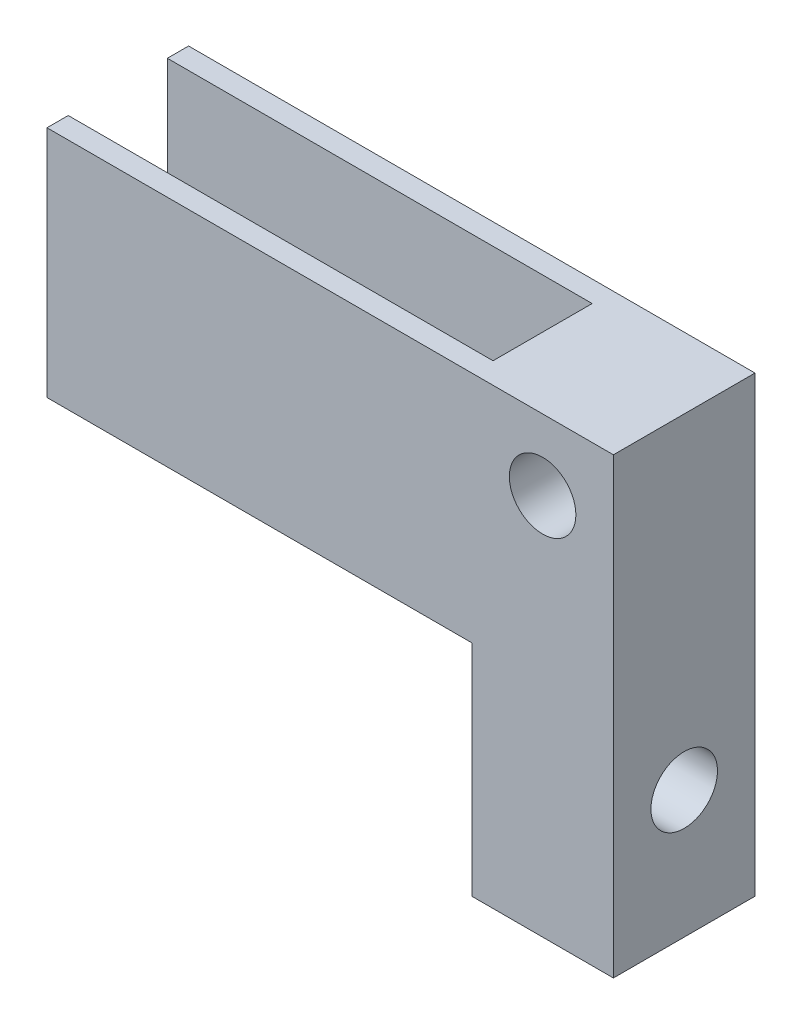
ISO-10303-21;
HEADER;
FILE_DESCRIPTION(('STEP AP214'),'2;1');
FILE_NAME('part.step','',(''),(''),'','','');
FILE_SCHEMA(('AUTOMOTIVE_DESIGN { 1 0 10303 214 1 1 1 1 }'));
ENDSEC;
DATA;
#1=APPLICATION_CONTEXT('core data for automotive mechanical design processes');
#2=APPLICATION_PROTOCOL_DEFINITION('international standard','automotive_design',2000,#1);
#3=PRODUCT_CONTEXT('',#1,'mechanical');
#4=PRODUCT('Part','Part','',(#3));
#5=PRODUCT_RELATED_PRODUCT_CATEGORY('part','',(#4));
#6=PRODUCT_DEFINITION_FORMATION('','',#4);
#7=PRODUCT_DEFINITION_CONTEXT('part definition',#1,'design');
#8=PRODUCT_DEFINITION('design','',#6,#7);
#9=PRODUCT_DEFINITION_SHAPE('','',#8);
#10=(LENGTH_UNIT() NAMED_UNIT(*) SI_UNIT(.MILLI.,.METRE.));
#11=(NAMED_UNIT(*) PLANE_ANGLE_UNIT() SI_UNIT($,.RADIAN.));
#12=(NAMED_UNIT(*) SI_UNIT($,.STERADIAN.) SOLID_ANGLE_UNIT());
#13=UNCERTAINTY_MEASURE_WITH_UNIT(LENGTH_MEASURE(1.E-05),#10,'distance_accuracy_value','');
#14=(GEOMETRIC_REPRESENTATION_CONTEXT(3) GLOBAL_UNCERTAINTY_ASSIGNED_CONTEXT((#13)) GLOBAL_UNIT_ASSIGNED_CONTEXT((#10,
#11,#12)) REPRESENTATION_CONTEXT('',''));
#15=CARTESIAN_POINT('',(0.,0.,0.));
#16=DIRECTION('',(0.,0.,1.));
#17=DIRECTION('',(1.,0.,0.));
#18=AXIS2_PLACEMENT_3D('',#15,#16,#17);
#19=CARTESIAN_POINT('',(0.,0.,10.));
#20=DIRECTION('',(-1.,0.,0.));
#21=DIRECTION('',(0.,-1.,0.));
#22=AXIS2_PLACEMENT_3D('',#19,#20,#21);
#23=PLANE('',#22);
#24=DIRECTION('',(0.,0.,1.));
#25=VECTOR('',#24,1.);
#26=CARTESIAN_POINT('',(0.,32.,10.));
#27=LINE('',#26,#25);
#28=CARTESIAN_POINT('',(0.,32.,1.5));
#29=VERTEX_POINT('',#28);
#30=CARTESIAN_POINT('',(0.,32.,8.5));
#31=VERTEX_POINT('',#30);
#32=EDGE_CURVE('E197',#29,#31,#27,.T.);
#33=ORIENTED_EDGE('',*,*,#32,.F.);
#34=DIRECTION('',(0.,1.,0.));
#35=VECTOR('',#34,1.);
#36=CARTESIAN_POINT('',(0.,36.5,1.5));
#37=LINE('',#36,#35);
#38=CARTESIAN_POINT('',(0.,15.5,1.5));
#39=VERTEX_POINT('',#38);
#40=EDGE_CURVE('E184',#39,#29,#37,.T.);
#41=ORIENTED_EDGE('',*,*,#40,.F.);
#42=DIRECTION('',(0.,0.,1.));
#43=VECTOR('',#42,1.);
#44=CARTESIAN_POINT('',(0.,15.5,1.5));
#45=LINE('',#44,#43);
#46=CARTESIAN_POINT('',(0.,15.5,0.));
#47=VERTEX_POINT('',#46);
#48=EDGE_CURVE('E115',#47,#39,#45,.T.);
#49=ORIENTED_EDGE('',*,*,#48,.F.);
#50=DIRECTION('',(0.,1.,0.));
#51=VECTOR('',#50,1.);
#52=CARTESIAN_POINT('',(0.,0.,0.));
#53=LINE('',#52,#51);
#54=CARTESIAN_POINT('',(0.,0.,0.));
#55=VERTEX_POINT('',#54);
#56=EDGE_CURVE('E136',#55,#47,#53,.T.);
#57=ORIENTED_EDGE('',*,*,#56,.F.);
#58=DIRECTION('',(0.,0.,-1.));
#59=VECTOR('',#58,1.);
#60=CARTESIAN_POINT('',(0.,0.,10.));
#61=LINE('',#60,#59);
#62=CARTESIAN_POINT('',(0.,0.,10.));
#63=VERTEX_POINT('',#62);
#64=EDGE_CURVE('E41',#63,#55,#61,.T.);
#65=ORIENTED_EDGE('',*,*,#64,.F.);
#66=DIRECTION('',(0.,1.,0.));
#67=VECTOR('',#66,1.);
#68=CARTESIAN_POINT('',(0.,0.,10.));
#69=LINE('',#68,#67);
#70=CARTESIAN_POINT('',(0.,15.5,10.));
#71=VERTEX_POINT('',#70);
#72=EDGE_CURVE('E55',#63,#71,#69,.T.);
#73=ORIENTED_EDGE('',*,*,#72,.T.);
#74=DIRECTION('',(0.,0.,1.));
#75=VECTOR('',#74,1.);
#76=CARTESIAN_POINT('',(0.,15.5,8.5));
#77=LINE('',#76,#75);
#78=CARTESIAN_POINT('',(0.,15.5,8.5));
#79=VERTEX_POINT('',#78);
#80=EDGE_CURVE('E168',#79,#71,#77,.T.);
#81=ORIENTED_EDGE('',*,*,#80,.F.);
#82=DIRECTION('',(0.,-1.,0.));
#83=VECTOR('',#82,1.);
#84=CARTESIAN_POINT('',(0.,36.5,8.5));
#85=LINE('',#84,#83);
#86=EDGE_CURVE('E171',#31,#79,#85,.T.);
#87=ORIENTED_EDGE('',*,*,#86,.F.);
#88=EDGE_LOOP('',(#33,#41,#49,#57,#65,#73,#81,#87));
#89=FACE_BOUND('',#88,.T.);
#90=CARTESIAN_POINT('',(0.,9.,5.));
#91=DIRECTION('',(-1.,0.,0.));
#92=DIRECTION('',(0.,-1.,0.));
#93=AXIS2_PLACEMENT_3D('',#90,#91,#92);
#94=CIRCLE('',#93,2.35);
#95=CARTESIAN_POINT('',(0.,6.65,5.));
#96=VERTEX_POINT('',#95);
#97=EDGE_CURVE('E156',#96,#96,#94,.T.);
#98=ORIENTED_EDGE('',*,*,#97,.F.);
#99=EDGE_LOOP('',(#98));
#100=FACE_BOUND('',#99,.T.);
#101=ADVANCED_FACE('F33',(#89,#100),#23,.T.);
#102=CARTESIAN_POINT('',(9.99999999999999,50.,10.));
#103=DIRECTION('',(1.,0.,0.));
#104=DIRECTION('',(0.,1.,0.));
#105=AXIS2_PLACEMENT_3D('',#102,#103,#104);
#106=PLANE('',#105);
#107=DIRECTION('',(0.,0.,-1.));
#108=VECTOR('',#107,1.);
#109=CARTESIAN_POINT('',(9.99999999999999,32.,10.));
#110=LINE('',#109,#108);
#111=CARTESIAN_POINT('',(9.99999999999998,32.,10.));
#112=VERTEX_POINT('',#111);
#113=CARTESIAN_POINT('',(9.99999999999998,32.,0.));
#114=VERTEX_POINT('',#113);
#115=EDGE_CURVE('E108',#112,#114,#110,.T.);
#116=ORIENTED_EDGE('',*,*,#115,.F.);
#117=DIRECTION('',(0.,-1.,0.));
#118=VECTOR('',#117,1.);
#119=CARTESIAN_POINT('',(9.99999999999999,50.,10.));
#120=LINE('',#119,#118);
#121=CARTESIAN_POINT('',(10.,0.,10.));
#122=VERTEX_POINT('',#121);
#123=EDGE_CURVE('E146',#112,#122,#120,.T.);
#124=ORIENTED_EDGE('',*,*,#123,.T.);
#125=DIRECTION('',(0.,0.,-1.));
#126=VECTOR('',#125,1.);
#127=CARTESIAN_POINT('',(10.,0.,10.));
#128=LINE('',#127,#126);
#129=CARTESIAN_POINT('',(10.,0.,0.));
#130=VERTEX_POINT('',#129);
#131=EDGE_CURVE('E131',#122,#130,#128,.T.);
#132=ORIENTED_EDGE('',*,*,#131,.T.);
#133=DIRECTION('',(0.,-1.,0.));
#134=VECTOR('',#133,1.);
#135=CARTESIAN_POINT('',(9.99999999999999,50.,0.));
#136=LINE('',#135,#134);
#137=EDGE_CURVE('E123',#114,#130,#136,.T.);
#138=ORIENTED_EDGE('',*,*,#137,.F.);
#139=EDGE_LOOP('',(#116,#124,#132,#138));
#140=FACE_BOUND('',#139,.T.);
#141=CARTESIAN_POINT('',(10.,9.,5.));
#142=DIRECTION('',(-1.,0.,0.));
#143=DIRECTION('',(0.,-1.,0.));
#144=AXIS2_PLACEMENT_3D('',#141,#142,#143);
#145=CIRCLE('',#144,2.35);
#146=CARTESIAN_POINT('',(10.,6.65,5.));
#147=VERTEX_POINT('',#146);
#148=EDGE_CURVE('E154',#147,#147,#145,.T.);
#149=ORIENTED_EDGE('',*,*,#148,.T.);
#150=EDGE_LOOP('',(#149));
#151=FACE_BOUND('',#150,.T.);
#152=ADVANCED_FACE('F35',(#140,#151),#106,.T.);
#153=CARTESIAN_POINT('',(10.,0.,10.));
#154=DIRECTION('',(0.,-1.,0.));
#155=DIRECTION('',(1.,0.,0.));
#156=AXIS2_PLACEMENT_3D('',#153,#154,#155);
#157=PLANE('',#156);
#158=DIRECTION('',(-1.,0.,0.));
#159=VECTOR('',#158,1.);
#160=CARTESIAN_POINT('',(10.,0.,0.));
#161=LINE('',#160,#159);
#162=EDGE_CURVE('E133',#130,#55,#161,.T.);
#163=ORIENTED_EDGE('',*,*,#162,.F.);
#164=ORIENTED_EDGE('',*,*,#131,.F.);
#165=DIRECTION('',(-1.,0.,0.));
#166=VECTOR('',#165,1.);
#167=CARTESIAN_POINT('',(10.,0.,10.));
#168=LINE('',#167,#166);
#169=EDGE_CURVE('E147',#122,#63,#168,.T.);
#170=ORIENTED_EDGE('',*,*,#169,.T.);
#171=ORIENTED_EDGE('',*,*,#64,.T.);
#172=EDGE_LOOP('',(#163,#164,#170,#171));
#173=FACE_BOUND('',#172,.T.);
#174=ADVANCED_FACE('F228',(#173),#157,.T.);
#175=CARTESIAN_POINT('',(0.,0.,10.));
#176=DIRECTION('',(0.,0.,-1.));
#177=DIRECTION('',(-1.,0.,0.));
#178=AXIS2_PLACEMENT_3D('',#175,#176,#177);
#179=PLANE('',#178);
#180=CARTESIAN_POINT('',(4.99999999999999,27.,10.));
#181=DIRECTION('',(0.,0.,1.));
#182=DIRECTION('',(1.,0.,0.));
#183=AXIS2_PLACEMENT_3D('',#180,#181,#182);
#184=CIRCLE('',#183,2.35);
#185=CARTESIAN_POINT('',(7.34999999999999,27.,10.));
#186=VERTEX_POINT('',#185);
#187=EDGE_CURVE('E139',#186,#186,#184,.T.);
#188=ORIENTED_EDGE('',*,*,#187,.F.);
#189=EDGE_LOOP('',(#188));
#190=FACE_BOUND('',#189,.T.);
#191=ORIENTED_EDGE('',*,*,#123,.F.);
#192=DIRECTION('',(1.,0.,0.));
#193=VECTOR('',#192,1.);
#194=CARTESIAN_POINT('',(-34.1391826025117,32.,10.));
#195=LINE('',#194,#193);
#196=CARTESIAN_POINT('',(-30.,32.,10.));
#197=VERTEX_POINT('',#196);
#198=EDGE_CURVE('E111',#197,#112,#195,.T.);
#199=ORIENTED_EDGE('',*,*,#198,.F.);
#200=DIRECTION('',(0.,1.,0.));
#201=VECTOR('',#200,1.);
#202=CARTESIAN_POINT('',(-30.,15.5,10.));
#203=LINE('',#202,#201);
#204=CARTESIAN_POINT('',(-30.,15.5,10.));
#205=VERTEX_POINT('',#204);
#206=EDGE_CURVE('E167',#205,#197,#203,.T.);
#207=ORIENTED_EDGE('',*,*,#206,.F.);
#208=DIRECTION('',(1.,0.,0.));
#209=VECTOR('',#208,1.);
#210=CARTESIAN_POINT('',(-30.,15.5,10.));
#211=LINE('',#210,#209);
#212=EDGE_CURVE('E164',#205,#71,#211,.T.);
#213=ORIENTED_EDGE('',*,*,#212,.T.);
#214=ORIENTED_EDGE('',*,*,#72,.F.);
#215=ORIENTED_EDGE('',*,*,#169,.F.);
#216=EDGE_LOOP('',(#191,#199,#207,#213,#214,#215));
#217=FACE_BOUND('',#216,.T.);
#218=ADVANCED_FACE('F227',(#190,#217),#179,.F.);
#219=CARTESIAN_POINT('',(0.,0.,0.));
#220=DIRECTION('',(0.,0.,-1.));
#221=DIRECTION('',(-1.,0.,0.));
#222=AXIS2_PLACEMENT_3D('',#219,#220,#221);
#223=PLANE('',#222);
#224=DIRECTION('',(1.,0.,0.));
#225=VECTOR('',#224,1.);
#226=CARTESIAN_POINT('',(-34.1391826025117,32.,0.));
#227=LINE('',#226,#225);
#228=CARTESIAN_POINT('',(-30.,32.,0.));
#229=VERTEX_POINT('',#228);
#230=EDGE_CURVE('E48',#229,#114,#227,.T.);
#231=ORIENTED_EDGE('',*,*,#230,.T.);
#232=ORIENTED_EDGE('',*,*,#137,.T.);
#233=ORIENTED_EDGE('',*,*,#162,.T.);
#234=ORIENTED_EDGE('',*,*,#56,.T.);
#235=DIRECTION('',(1.,0.,0.));
#236=VECTOR('',#235,1.);
#237=CARTESIAN_POINT('',(-30.,15.5,0.));
#238=LINE('',#237,#236);
#239=CARTESIAN_POINT('',(-30.,15.5,0.));
#240=VERTEX_POINT('',#239);
#241=EDGE_CURVE('E173',#240,#47,#238,.T.);
#242=ORIENTED_EDGE('',*,*,#241,.F.);
#243=DIRECTION('',(0.,-1.,0.));
#244=VECTOR('',#243,1.);
#245=CARTESIAN_POINT('',(-30.,15.5,0.));
#246=LINE('',#245,#244);
#247=EDGE_CURVE('E126',#229,#240,#246,.T.);
#248=ORIENTED_EDGE('',*,*,#247,.F.);
#249=EDGE_LOOP('',(#231,#232,#233,#234,#242,#248));
#250=FACE_BOUND('',#249,.T.);
#251=CARTESIAN_POINT('',(4.99999999999999,27.,0.));
#252=DIRECTION('',(0.,0.,1.));
#253=DIRECTION('',(1.,0.,0.));
#254=AXIS2_PLACEMENT_3D('',#251,#252,#253);
#255=CIRCLE('',#254,2.35);
#256=CARTESIAN_POINT('',(7.34999999999999,27.,0.));
#257=VERTEX_POINT('',#256);
#258=EDGE_CURVE('E134',#257,#257,#255,.T.);
#259=ORIENTED_EDGE('',*,*,#258,.T.);
#260=EDGE_LOOP('',(#259));
#261=FACE_BOUND('',#260,.T.);
#262=ADVANCED_FACE('F120',(#250,#261),#223,.T.);
#263=CARTESIAN_POINT('',(4.99999999999999,27.,0.));
#264=DIRECTION('',(0.,0.,1.));
#265=DIRECTION('',(1.,0.,0.));
#266=AXIS2_PLACEMENT_3D('',#263,#264,#265);
#267=CYLINDRICAL_SURFACE('',#266,2.35);
#268=ORIENTED_EDGE('',*,*,#258,.F.);
#269=EDGE_LOOP('',(#268));
#270=FACE_BOUND('',#269,.T.);
#271=ORIENTED_EDGE('',*,*,#187,.T.);
#272=EDGE_LOOP('',(#271));
#273=FACE_BOUND('',#272,.T.);
#274=ADVANCED_FACE('F255',(#270,#273),#267,.F.);
#275=CARTESIAN_POINT('',(10.,9.,5.));
#276=DIRECTION('',(-1.,0.,0.));
#277=DIRECTION('',(0.,-1.,0.));
#278=AXIS2_PLACEMENT_3D('',#275,#276,#277);
#279=CYLINDRICAL_SURFACE('',#278,2.35);
#280=ORIENTED_EDGE('',*,*,#148,.F.);
#281=EDGE_LOOP('',(#280));
#282=FACE_BOUND('',#281,.T.);
#283=ORIENTED_EDGE('',*,*,#97,.T.);
#284=EDGE_LOOP('',(#283));
#285=FACE_BOUND('',#284,.T.);
#286=ADVANCED_FACE('F238',(#282,#285),#279,.F.);
#287=CARTESIAN_POINT('',(-30.,36.5,8.5));
#288=DIRECTION('',(0.,0.,1.));
#289=DIRECTION('',(0.,-1.,0.));
#290=AXIS2_PLACEMENT_3D('',#287,#288,#289);
#291=PLANE('',#290);
#292=DIRECTION('',(0.,-1.,0.));
#293=VECTOR('',#292,1.);
#294=CARTESIAN_POINT('',(-30.,36.5,8.5));
#295=LINE('',#294,#293);
#296=CARTESIAN_POINT('',(-30.,32.,8.5));
#297=VERTEX_POINT('',#296);
#298=CARTESIAN_POINT('',(-30.,15.5,8.5));
#299=VERTEX_POINT('',#298);
#300=EDGE_CURVE('E170',#297,#299,#295,.T.);
#301=ORIENTED_EDGE('',*,*,#300,.F.);
#302=DIRECTION('',(1.,0.,0.));
#303=VECTOR('',#302,1.);
#304=CARTESIAN_POINT('',(-30.,32.,8.5));
#305=LINE('',#304,#303);
#306=EDGE_CURVE('E194',#297,#31,#305,.T.);
#307=ORIENTED_EDGE('',*,*,#306,.T.);
#308=ORIENTED_EDGE('',*,*,#86,.T.);
#309=DIRECTION('',(1.,0.,0.));
#310=VECTOR('',#309,1.);
#311=CARTESIAN_POINT('',(-30.,15.5,8.5));
#312=LINE('',#311,#310);
#313=EDGE_CURVE('E159',#299,#79,#312,.T.);
#314=ORIENTED_EDGE('',*,*,#313,.F.);
#315=EDGE_LOOP('',(#301,#307,#308,#314));
#316=FACE_BOUND('',#315,.T.);
#317=ADVANCED_FACE('F219',(#316),#291,.F.);
#318=CARTESIAN_POINT('',(-30.,15.5,8.5));
#319=DIRECTION('',(0.,1.,0.));
#320=DIRECTION('',(0.,0.,1.));
#321=AXIS2_PLACEMENT_3D('',#318,#319,#320);
#322=PLANE('',#321);
#323=ORIENTED_EDGE('',*,*,#80,.T.);
#324=ORIENTED_EDGE('',*,*,#212,.F.);
#325=DIRECTION('',(0.,0.,1.));
#326=VECTOR('',#325,1.);
#327=CARTESIAN_POINT('',(-30.,15.5,8.5));
#328=LINE('',#327,#326);
#329=EDGE_CURVE('E176',#299,#205,#328,.T.);
#330=ORIENTED_EDGE('',*,*,#329,.F.);
#331=ORIENTED_EDGE('',*,*,#313,.T.);
#332=EDGE_LOOP('',(#323,#324,#330,#331));
#333=FACE_BOUND('',#332,.T.);
#334=ADVANCED_FACE('F230',(#333),#322,.F.);
#335=CARTESIAN_POINT('',(-30.,0.,0.));
#336=DIRECTION('',(-1.,0.,0.));
#337=DIRECTION('',(0.,-1.,0.));
#338=AXIS2_PLACEMENT_3D('',#335,#336,#337);
#339=PLANE('',#338);
#340=DIRECTION('',(0.,0.,1.));
#341=VECTOR('',#340,1.);
#342=CARTESIAN_POINT('',(-30.,32.,0.));
#343=LINE('',#342,#341);
#344=EDGE_CURVE('E116',#297,#197,#343,.T.);
#345=ORIENTED_EDGE('',*,*,#344,.F.);
#346=ORIENTED_EDGE('',*,*,#300,.T.);
#347=ORIENTED_EDGE('',*,*,#329,.T.);
#348=ORIENTED_EDGE('',*,*,#206,.T.);
#349=EDGE_LOOP('',(#345,#346,#347,#348));
#350=FACE_BOUND('',#349,.T.);
#351=ADVANCED_FACE('F223',(#350),#339,.T.);
#352=CARTESIAN_POINT('',(-30.,15.5,1.5));
#353=DIRECTION('',(0.,1.,0.));
#354=DIRECTION('',(-1.,0.,0.));
#355=AXIS2_PLACEMENT_3D('',#352,#353,#354);
#356=PLANE('',#355);
#357=ORIENTED_EDGE('',*,*,#48,.T.);
#358=DIRECTION('',(1.,0.,0.));
#359=VECTOR('',#358,1.);
#360=CARTESIAN_POINT('',(-30.,15.5,1.5));
#361=LINE('',#360,#359);
#362=CARTESIAN_POINT('',(-30.,15.5,1.5));
#363=VERTEX_POINT('',#362);
#364=EDGE_CURVE('E180',#363,#39,#361,.T.);
#365=ORIENTED_EDGE('',*,*,#364,.F.);
#366=DIRECTION('',(0.,0.,1.));
#367=VECTOR('',#366,1.);
#368=CARTESIAN_POINT('',(-30.,15.5,1.5));
#369=LINE('',#368,#367);
#370=EDGE_CURVE('E190',#240,#363,#369,.T.);
#371=ORIENTED_EDGE('',*,*,#370,.F.);
#372=ORIENTED_EDGE('',*,*,#241,.T.);
#373=EDGE_LOOP('',(#357,#365,#371,#372));
#374=FACE_BOUND('',#373,.T.);
#375=ADVANCED_FACE('F211',(#374),#356,.F.);
#376=CARTESIAN_POINT('',(-30.,36.5,1.5));
#377=DIRECTION('',(0.,0.,-1.));
#378=DIRECTION('',(0.,1.,0.));
#379=AXIS2_PLACEMENT_3D('',#376,#377,#378);
#380=PLANE('',#379);
#381=ORIENTED_EDGE('',*,*,#40,.T.);
#382=DIRECTION('',(-1.,0.,0.));
#383=VECTOR('',#382,1.);
#384=CARTESIAN_POINT('',(-30.,32.,1.5));
#385=LINE('',#384,#383);
#386=CARTESIAN_POINT('',(-30.,32.,1.5));
#387=VERTEX_POINT('',#386);
#388=EDGE_CURVE('E127',#29,#387,#385,.T.);
#389=ORIENTED_EDGE('',*,*,#388,.T.);
#390=DIRECTION('',(0.,1.,0.));
#391=VECTOR('',#390,1.);
#392=CARTESIAN_POINT('',(-30.,36.5,1.5));
#393=LINE('',#392,#391);
#394=EDGE_CURVE('E183',#363,#387,#393,.T.);
#395=ORIENTED_EDGE('',*,*,#394,.F.);
#396=ORIENTED_EDGE('',*,*,#364,.T.);
#397=EDGE_LOOP('',(#381,#389,#395,#396));
#398=FACE_BOUND('',#397,.T.);
#399=ADVANCED_FACE('F203',(#398),#380,.F.);
#400=CARTESIAN_POINT('',(-30.,0.,0.));
#401=DIRECTION('',(1.,0.,0.));
#402=DIRECTION('',(0.,1.,0.));
#403=AXIS2_PLACEMENT_3D('',#400,#401,#402);
#404=PLANE('',#403);
#405=ORIENTED_EDGE('',*,*,#394,.T.);
#406=DIRECTION('',(0.,0.,-1.));
#407=VECTOR('',#406,1.);
#408=CARTESIAN_POINT('',(-30.,32.,0.));
#409=LINE('',#408,#407);
#410=EDGE_CURVE('E11',#387,#229,#409,.T.);
#411=ORIENTED_EDGE('',*,*,#410,.T.);
#412=ORIENTED_EDGE('',*,*,#247,.T.);
#413=ORIENTED_EDGE('',*,*,#370,.T.);
#414=EDGE_LOOP('',(#405,#411,#412,#413));
#415=FACE_BOUND('',#414,.T.);
#416=ADVANCED_FACE('F207',(#415),#404,.F.);
#417=CARTESIAN_POINT('',(-34.1391826025117,32.,0.));
#418=DIRECTION('',(0.,-1.,0.));
#419=DIRECTION('',(0.,0.,-1.));
#420=AXIS2_PLACEMENT_3D('',#417,#418,#419);
#421=PLANE('',#420);
#422=ORIENTED_EDGE('',*,*,#115,.T.);
#423=ORIENTED_EDGE('',*,*,#230,.F.);
#424=ORIENTED_EDGE('',*,*,#410,.F.);
#425=ORIENTED_EDGE('',*,*,#388,.F.);
#426=ORIENTED_EDGE('',*,*,#32,.T.);
#427=ORIENTED_EDGE('',*,*,#306,.F.);
#428=ORIENTED_EDGE('',*,*,#344,.T.);
#429=ORIENTED_EDGE('',*,*,#198,.T.);
#430=EDGE_LOOP('',(#422,#423,#424,#425,#426,#427,#428,#429));
#431=FACE_BOUND('',#430,.T.);
#432=ADVANCED_FACE('F109',(#431),#421,.F.);
#433=CLOSED_SHELL('',(#101,#152,#174,#218,#262,#274,#286,#317,#334,#351,#375,#399,#416,#432));
#434=MANIFOLD_SOLID_BREP('B2',#433);
#435=ADVANCED_BREP_SHAPE_REPRESENTATION('',(#18,#434),#14);
#436=SHAPE_DEFINITION_REPRESENTATION(#9,#435);
ENDSEC;
END-ISO-10303-21;
